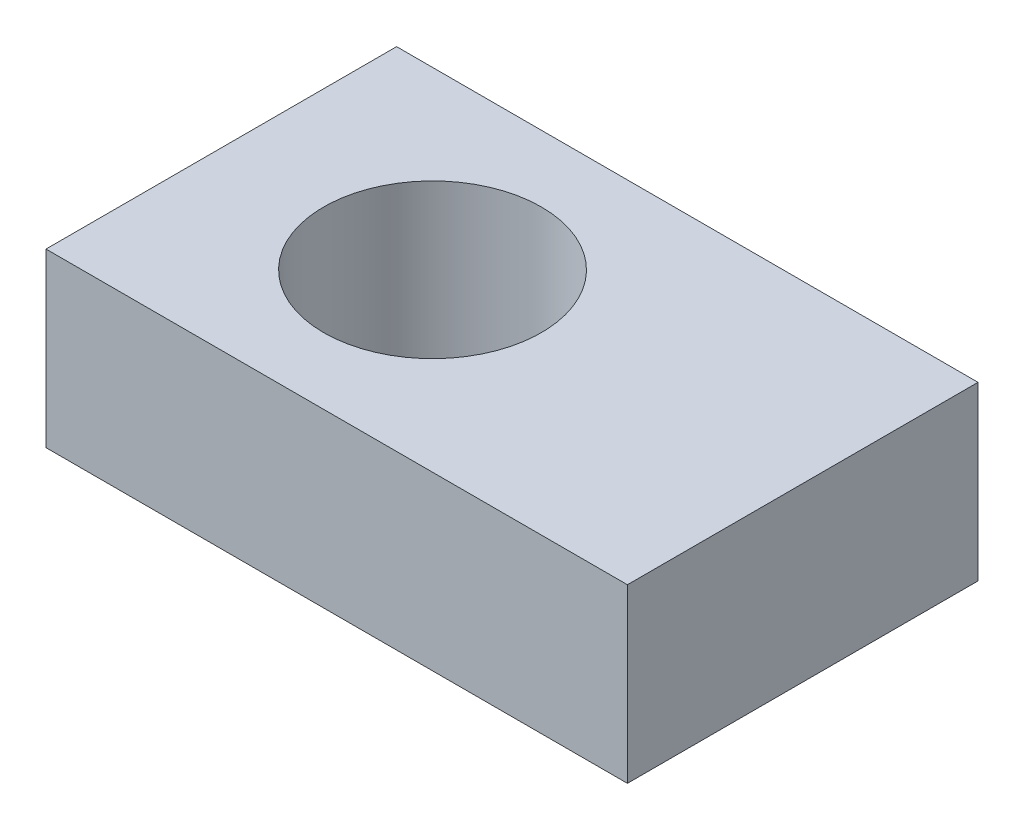
ISO-10303-21;
HEADER;
FILE_DESCRIPTION(('STEP AP214'),'2;1');
FILE_NAME('part.step','',(''),(''),'','','');
FILE_SCHEMA(('AUTOMOTIVE_DESIGN { 1 0 10303 214 1 1 1 1 }'));
ENDSEC;
DATA;
#1=APPLICATION_CONTEXT('core data for automotive mechanical design processes');
#2=APPLICATION_PROTOCOL_DEFINITION('international standard','automotive_design',2000,#1);
#3=PRODUCT_CONTEXT('',#1,'mechanical');
#4=PRODUCT('Part','Part','',(#3));
#5=PRODUCT_RELATED_PRODUCT_CATEGORY('part','',(#4));
#6=PRODUCT_DEFINITION_FORMATION('','',#4);
#7=PRODUCT_DEFINITION_CONTEXT('part definition',#1,'design');
#8=PRODUCT_DEFINITION('design','',#6,#7);
#9=PRODUCT_DEFINITION_SHAPE('','',#8);
#10=(LENGTH_UNIT() NAMED_UNIT(*) SI_UNIT(.MILLI.,.METRE.));
#11=(NAMED_UNIT(*) PLANE_ANGLE_UNIT() SI_UNIT($,.RADIAN.));
#12=(NAMED_UNIT(*) SI_UNIT($,.STERADIAN.) SOLID_ANGLE_UNIT());
#13=UNCERTAINTY_MEASURE_WITH_UNIT(LENGTH_MEASURE(1.E-05),#10,'distance_accuracy_value','');
#14=(GEOMETRIC_REPRESENTATION_CONTEXT(3) GLOBAL_UNCERTAINTY_ASSIGNED_CONTEXT((#13)) GLOBAL_UNIT_ASSIGNED_CONTEXT((#10,
#11,#12)) REPRESENTATION_CONTEXT('',''));
#15=CARTESIAN_POINT('',(0.,0.,0.));
#16=DIRECTION('',(0.,0.,1.));
#17=DIRECTION('',(1.,0.,0.));
#18=AXIS2_PLACEMENT_3D('',#15,#16,#17);
#19=CARTESIAN_POINT('',(34.43,-0.06,12.38));
#20=DIRECTION('',(0.,-1.,0.));
#21=DIRECTION('',(0.,0.,-1.));
#22=AXIS2_PLACEMENT_3D('',#19,#20,#21);
#23=PLANE('',#22);
#24=CARTESIAN_POINT('',(33.7,-0.0599999999999999,12.38));
#25=DIRECTION('',(0.,-1.,0.));
#26=DIRECTION('',(0.,0.,-1.));
#27=AXIS2_PLACEMENT_3D('',#24,#25,#26);
#28=CIRCLE('',#27,1.);
#29=CARTESIAN_POINT('',(33.7,-0.0599999999999999,11.38));
#30=VERTEX_POINT('',#29);
#31=EDGE_CURVE('E20',#30,#30,#28,.F.);
#32=ORIENTED_EDGE('',*,*,#31,.T.);
#33=EDGE_LOOP('',(#32));
#34=FACE_BOUND('',#33,.T.);
#35=DIRECTION('',(-1.,0.,0.));
#36=VECTOR('',#35,1.);
#37=CARTESIAN_POINT('',(31.76,-0.0599999999999999,10.77));
#38=LINE('',#37,#36);
#39=CARTESIAN_POINT('',(37.1,-0.06,10.77));
#40=VERTEX_POINT('',#39);
#41=CARTESIAN_POINT('',(31.76,-0.06,10.77));
#42=VERTEX_POINT('',#41);
#43=EDGE_CURVE('E69',#40,#42,#38,.T.);
#44=ORIENTED_EDGE('',*,*,#43,.F.);
#45=DIRECTION('',(0.,0.,-1.));
#46=VECTOR('',#45,1.);
#47=CARTESIAN_POINT('',(37.1,-0.0599999999999999,10.77));
#48=LINE('',#47,#46);
#49=CARTESIAN_POINT('',(37.1,-0.06,13.99));
#50=VERTEX_POINT('',#49);
#51=EDGE_CURVE('E54',#50,#40,#48,.T.);
#52=ORIENTED_EDGE('',*,*,#51,.F.);
#53=DIRECTION('',(1.,0.,0.));
#54=VECTOR('',#53,1.);
#55=CARTESIAN_POINT('',(37.1,-0.0599999999999999,13.99));
#56=LINE('',#55,#54);
#57=CARTESIAN_POINT('',(31.76,-0.06,13.99));
#58=VERTEX_POINT('',#57);
#59=EDGE_CURVE('E59',#58,#50,#56,.T.);
#60=ORIENTED_EDGE('',*,*,#59,.F.);
#61=DIRECTION('',(0.,0.,1.));
#62=VECTOR('',#61,1.);
#63=CARTESIAN_POINT('',(31.76,-0.0599999999999999,13.99));
#64=LINE('',#63,#62);
#65=EDGE_CURVE('E82',#42,#58,#64,.T.);
#66=ORIENTED_EDGE('',*,*,#65,.F.);
#67=EDGE_LOOP('',(#44,#52,#60,#66));
#68=FACE_BOUND('',#67,.T.);
#69=ADVANCED_FACE('F17',(#34,#68),#23,.T.);
#70=CARTESIAN_POINT('',(37.1,1.52,13.99));
#71=DIRECTION('',(0.,0.,1.));
#72=DIRECTION('',(1.,0.,0.));
#73=AXIS2_PLACEMENT_3D('',#70,#71,#72);
#74=PLANE('',#73);
#75=ORIENTED_EDGE('',*,*,#59,.T.);
#76=DIRECTION('',(0.,1.,0.));
#77=VECTOR('',#76,1.);
#78=CARTESIAN_POINT('',(37.1,1.52,13.99));
#79=LINE('',#78,#77);
#80=CARTESIAN_POINT('',(37.1,1.52,13.99));
#81=VERTEX_POINT('',#80);
#82=EDGE_CURVE('E61',#81,#50,#79,.F.);
#83=ORIENTED_EDGE('',*,*,#82,.F.);
#84=DIRECTION('',(1.,0.,0.));
#85=VECTOR('',#84,1.);
#86=CARTESIAN_POINT('',(34.43,1.52,13.99));
#87=LINE('',#86,#85);
#88=CARTESIAN_POINT('',(31.76,1.52,13.99));
#89=VERTEX_POINT('',#88);
#90=EDGE_CURVE('E85',#89,#81,#87,.T.);
#91=ORIENTED_EDGE('',*,*,#90,.F.);
#92=DIRECTION('',(0.,1.,0.));
#93=VECTOR('',#92,1.);
#94=CARTESIAN_POINT('',(31.76,1.52,13.99));
#95=LINE('',#94,#93);
#96=EDGE_CURVE('E64',#58,#89,#95,.T.);
#97=ORIENTED_EDGE('',*,*,#96,.F.);
#98=EDGE_LOOP('',(#75,#83,#91,#97));
#99=FACE_BOUND('',#98,.T.);
#100=ADVANCED_FACE('F60',(#99),#74,.T.);
#101=CARTESIAN_POINT('',(37.1,1.52,10.77));
#102=DIRECTION('',(1.,0.,0.));
#103=DIRECTION('',(0.,0.,-1.));
#104=AXIS2_PLACEMENT_3D('',#101,#102,#103);
#105=PLANE('',#104);
#106=ORIENTED_EDGE('',*,*,#51,.T.);
#107=DIRECTION('',(0.,1.,0.));
#108=VECTOR('',#107,1.);
#109=CARTESIAN_POINT('',(37.1,1.52,10.77));
#110=LINE('',#109,#108);
#111=CARTESIAN_POINT('',(37.1,1.52,10.77));
#112=VERTEX_POINT('',#111);
#113=EDGE_CURVE('E71',#112,#40,#110,.F.);
#114=ORIENTED_EDGE('',*,*,#113,.F.);
#115=DIRECTION('',(0.,0.,1.));
#116=VECTOR('',#115,1.);
#117=CARTESIAN_POINT('',(37.1,1.52,12.38));
#118=LINE('',#117,#116);
#119=EDGE_CURVE('E75',#81,#112,#118,.F.);
#120=ORIENTED_EDGE('',*,*,#119,.F.);
#121=ORIENTED_EDGE('',*,*,#82,.T.);
#122=EDGE_LOOP('',(#106,#114,#120,#121));
#123=FACE_BOUND('',#122,.T.);
#124=ADVANCED_FACE('F73',(#123),#105,.T.);
#125=CARTESIAN_POINT('',(31.76,1.52,10.77));
#126=DIRECTION('',(0.,0.,-1.));
#127=DIRECTION('',(-1.,0.,0.));
#128=AXIS2_PLACEMENT_3D('',#125,#126,#127);
#129=PLANE('',#128);
#130=ORIENTED_EDGE('',*,*,#43,.T.);
#131=DIRECTION('',(0.,1.,0.));
#132=VECTOR('',#131,1.);
#133=CARTESIAN_POINT('',(31.76,1.52,10.77));
#134=LINE('',#133,#132);
#135=CARTESIAN_POINT('',(31.76,1.52,10.77));
#136=VERTEX_POINT('',#135);
#137=EDGE_CURVE('E34',#136,#42,#134,.F.);
#138=ORIENTED_EDGE('',*,*,#137,.F.);
#139=DIRECTION('',(1.,0.,0.));
#140=VECTOR('',#139,1.);
#141=CARTESIAN_POINT('',(34.43,1.52,10.77));
#142=LINE('',#141,#140);
#143=EDGE_CURVE('E88',#112,#136,#142,.F.);
#144=ORIENTED_EDGE('',*,*,#143,.F.);
#145=ORIENTED_EDGE('',*,*,#113,.T.);
#146=EDGE_LOOP('',(#130,#138,#144,#145));
#147=FACE_BOUND('',#146,.T.);
#148=ADVANCED_FACE('F98',(#147),#129,.T.);
#149=CARTESIAN_POINT('',(31.76,1.52,13.99));
#150=DIRECTION('',(-1.,0.,0.));
#151=DIRECTION('',(0.,0.,1.));
#152=AXIS2_PLACEMENT_3D('',#149,#150,#151);
#153=PLANE('',#152);
#154=ORIENTED_EDGE('',*,*,#65,.T.);
#155=ORIENTED_EDGE('',*,*,#96,.T.);
#156=DIRECTION('',(0.,0.,1.));
#157=VECTOR('',#156,1.);
#158=CARTESIAN_POINT('',(31.76,1.52,12.38));
#159=LINE('',#158,#157);
#160=EDGE_CURVE('E26',#136,#89,#159,.T.);
#161=ORIENTED_EDGE('',*,*,#160,.F.);
#162=ORIENTED_EDGE('',*,*,#137,.T.);
#163=EDGE_LOOP('',(#154,#155,#161,#162));
#164=FACE_BOUND('',#163,.T.);
#165=ADVANCED_FACE('F95',(#164),#153,.T.);
#166=CARTESIAN_POINT('',(33.7,1.52,12.38));
#167=DIRECTION('',(0.,-1.,0.));
#168=DIRECTION('',(0.,0.,-1.));
#169=AXIS2_PLACEMENT_3D('',#166,#167,#168);
#170=CYLINDRICAL_SURFACE('',#169,1.);
#171=ORIENTED_EDGE('',*,*,#31,.F.);
#172=EDGE_LOOP('',(#171));
#173=FACE_BOUND('',#172,.T.);
#174=CARTESIAN_POINT('',(33.7,1.52,12.38));
#175=DIRECTION('',(0.,-1.,0.));
#176=DIRECTION('',(0.,0.,-1.));
#177=AXIS2_PLACEMENT_3D('',#174,#175,#176);
#178=CIRCLE('',#177,1.);
#179=CARTESIAN_POINT('',(33.7,1.52,11.38));
#180=VERTEX_POINT('',#179);
#181=EDGE_CURVE('E11',#180,#180,#178,.T.);
#182=ORIENTED_EDGE('',*,*,#181,.F.);
#183=EDGE_LOOP('',(#182));
#184=FACE_BOUND('',#183,.T.);
#185=ADVANCED_FACE('F97',(#173,#184),#170,.F.);
#186=CARTESIAN_POINT('',(34.43,1.52,12.38));
#187=DIRECTION('',(0.,1.,0.));
#188=DIRECTION('',(0.,0.,1.));
#189=AXIS2_PLACEMENT_3D('',#186,#187,#188);
#190=PLANE('',#189);
#191=ORIENTED_EDGE('',*,*,#181,.T.);
#192=EDGE_LOOP('',(#191));
#193=FACE_BOUND('',#192,.T.);
#194=ORIENTED_EDGE('',*,*,#143,.T.);
#195=ORIENTED_EDGE('',*,*,#160,.T.);
#196=ORIENTED_EDGE('',*,*,#90,.T.);
#197=ORIENTED_EDGE('',*,*,#119,.T.);
#198=EDGE_LOOP('',(#194,#195,#196,#197));
#199=FACE_BOUND('',#198,.T.);
#200=ADVANCED_FACE('F93',(#193,#199),#190,.T.);
#201=CLOSED_SHELL('',(#69,#100,#124,#148,#165,#185,#200));
#202=MANIFOLD_SOLID_BREP('B1',#201);
#203=ADVANCED_BREP_SHAPE_REPRESENTATION('',(#18,#202),#14);
#204=SHAPE_DEFINITION_REPRESENTATION(#9,#203);
ENDSEC;
END-ISO-10303-21;
